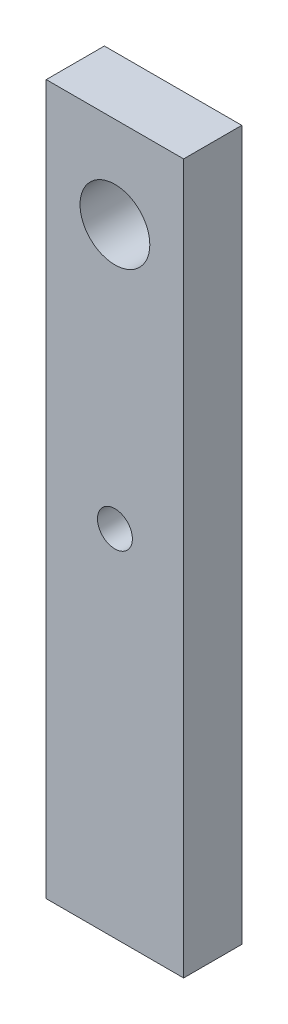
ISO-10303-21;
HEADER;
FILE_DESCRIPTION(('STEP AP214'),'2;1');
FILE_NAME('part.step','',(''),(''),'','','');
FILE_SCHEMA(('AUTOMOTIVE_DESIGN { 1 0 10303 214 1 1 1 1 }'));
ENDSEC;
DATA;
#1=APPLICATION_CONTEXT('core data for automotive mechanical design processes');
#2=APPLICATION_PROTOCOL_DEFINITION('international standard','automotive_design',2000,#1);
#3=PRODUCT_CONTEXT('',#1,'mechanical');
#4=PRODUCT('Part','Part','',(#3));
#5=PRODUCT_RELATED_PRODUCT_CATEGORY('part','',(#4));
#6=PRODUCT_DEFINITION_FORMATION('','',#4);
#7=PRODUCT_DEFINITION_CONTEXT('part definition',#1,'design');
#8=PRODUCT_DEFINITION('design','',#6,#7);
#9=PRODUCT_DEFINITION_SHAPE('','',#8);
#10=(LENGTH_UNIT() NAMED_UNIT(*) SI_UNIT(.MILLI.,.METRE.));
#11=(NAMED_UNIT(*) PLANE_ANGLE_UNIT() SI_UNIT($,.RADIAN.));
#12=(NAMED_UNIT(*) SI_UNIT($,.STERADIAN.) SOLID_ANGLE_UNIT());
#13=UNCERTAINTY_MEASURE_WITH_UNIT(LENGTH_MEASURE(1.E-05),#10,'distance_accuracy_value','');
#14=(GEOMETRIC_REPRESENTATION_CONTEXT(3) GLOBAL_UNCERTAINTY_ASSIGNED_CONTEXT((#13)) GLOBAL_UNIT_ASSIGNED_CONTEXT((#10,
#11,#12)) REPRESENTATION_CONTEXT('',''));
#15=CARTESIAN_POINT('',(0.,0.,0.));
#16=DIRECTION('',(0.,0.,1.));
#17=DIRECTION('',(1.,0.,0.));
#18=AXIS2_PLACEMENT_3D('',#15,#16,#17);
#19=CARTESIAN_POINT('',(0.,0.,10.));
#20=DIRECTION('',(0.,0.,-1.));
#21=DIRECTION('',(-1.,0.,0.));
#22=AXIS2_PLACEMENT_3D('',#19,#20,#21);
#23=PLANE('',#22);
#24=DIRECTION('',(0.,1.,0.));
#25=VECTOR('',#24,1.);
#26=CARTESIAN_POINT('',(11.8132314555088,-60.9892414679757,10.));
#27=LINE('',#26,#25);
#28=CARTESIAN_POINT('',(11.8132314555088,-60.9892414679757,10.));
#29=VERTEX_POINT('',#28);
#30=CARTESIAN_POINT('',(11.8132314555088,60.9892414679757,10.));
#31=VERTEX_POINT('',#30);
#32=EDGE_CURVE('E100',#29,#31,#27,.T.);
#33=ORIENTED_EDGE('',*,*,#32,.T.);
#34=DIRECTION('',(-1.,0.,0.));
#35=VECTOR('',#34,1.);
#36=CARTESIAN_POINT('',(-11.8132314555088,60.9892414679757,10.));
#37=LINE('',#36,#35);
#38=CARTESIAN_POINT('',(-11.8132314555088,60.9892414679757,10.));
#39=VERTEX_POINT('',#38);
#40=EDGE_CURVE('E95',#31,#39,#37,.T.);
#41=ORIENTED_EDGE('',*,*,#40,.T.);
#42=DIRECTION('',(0.,-1.,0.));
#43=VECTOR('',#42,1.);
#44=CARTESIAN_POINT('',(-11.8132314555088,-60.9892414679757,10.));
#45=LINE('',#44,#43);
#46=CARTESIAN_POINT('',(-11.8132314555088,-60.9892414679757,10.));
#47=VERTEX_POINT('',#46);
#48=EDGE_CURVE('E98',#39,#47,#45,.T.);
#49=ORIENTED_EDGE('',*,*,#48,.T.);
#50=DIRECTION('',(1.,0.,0.));
#51=VECTOR('',#50,1.);
#52=CARTESIAN_POINT('',(-11.8132314555088,-60.9892414679757,10.));
#53=LINE('',#52,#51);
#54=EDGE_CURVE('E65',#47,#29,#53,.T.);
#55=ORIENTED_EDGE('',*,*,#54,.T.);
#56=EDGE_LOOP('',(#33,#41,#49,#55));
#57=FACE_BOUND('',#56,.T.);
#58=CARTESIAN_POINT('',(0.,0.,10.));
#59=DIRECTION('',(0.,0.,1.));
#60=DIRECTION('',(1.,0.,0.));
#61=AXIS2_PLACEMENT_3D('',#58,#59,#60);
#62=CIRCLE('',#61,3.);
#63=CARTESIAN_POINT('',(3.,0.,10.));
#64=VERTEX_POINT('',#63);
#65=EDGE_CURVE('E120',#64,#64,#62,.T.);
#66=ORIENTED_EDGE('',*,*,#65,.F.);
#67=EDGE_LOOP('',(#66));
#68=FACE_BOUND('',#67,.T.);
#69=CARTESIAN_POINT('',(0.,45.2994882944264,10.));
#70=DIRECTION('',(0.,0.,1.));
#71=DIRECTION('',(1.,0.,0.));
#72=AXIS2_PLACEMENT_3D('',#69,#70,#71);
#73=CIRCLE('',#72,6.);
#74=CARTESIAN_POINT('',(6.,45.2994882944264,10.));
#75=VERTEX_POINT('',#74);
#76=EDGE_CURVE('E142',#75,#75,#73,.T.);
#77=ORIENTED_EDGE('',*,*,#76,.F.);
#78=EDGE_LOOP('',(#77));
#79=FACE_BOUND('',#78,.T.);
#80=ADVANCED_FACE('F47',(#57,#68,#79),#23,.F.);
#81=CARTESIAN_POINT('',(0.,0.,0.));
#82=DIRECTION('',(0.,0.,-1.));
#83=DIRECTION('',(-1.,0.,0.));
#84=AXIS2_PLACEMENT_3D('',#81,#82,#83);
#85=PLANE('',#84);
#86=CARTESIAN_POINT('',(0.,0.,0.));
#87=DIRECTION('',(0.,0.,1.));
#88=DIRECTION('',(1.,0.,0.));
#89=AXIS2_PLACEMENT_3D('',#86,#87,#88);
#90=CIRCLE('',#89,3.);
#91=CARTESIAN_POINT('',(3.,0.,0.));
#92=VERTEX_POINT('',#91);
#93=EDGE_CURVE('E138',#92,#92,#90,.T.);
#94=ORIENTED_EDGE('',*,*,#93,.T.);
#95=EDGE_LOOP('',(#94));
#96=FACE_BOUND('',#95,.T.);
#97=DIRECTION('',(0.,1.,0.));
#98=VECTOR('',#97,1.);
#99=CARTESIAN_POINT('',(11.8132314555088,-60.9892414679757,0.));
#100=LINE('',#99,#98);
#101=CARTESIAN_POINT('',(11.8132314555088,-60.9892414679757,0.));
#102=VERTEX_POINT('',#101);
#103=CARTESIAN_POINT('',(11.8132314555088,60.9892414679757,0.));
#104=VERTEX_POINT('',#103);
#105=EDGE_CURVE('E116',#102,#104,#100,.T.);
#106=ORIENTED_EDGE('',*,*,#105,.F.);
#107=DIRECTION('',(1.,0.,0.));
#108=VECTOR('',#107,1.);
#109=CARTESIAN_POINT('',(-11.8132314555088,-60.9892414679757,0.));
#110=LINE('',#109,#108);
#111=CARTESIAN_POINT('',(-11.8132314555088,-60.9892414679757,0.));
#112=VERTEX_POINT('',#111);
#113=EDGE_CURVE('E88',#112,#102,#110,.T.);
#114=ORIENTED_EDGE('',*,*,#113,.F.);
#115=DIRECTION('',(0.,-1.,0.));
#116=VECTOR('',#115,1.);
#117=CARTESIAN_POINT('',(-11.8132314555088,-60.9892414679757,0.));
#118=LINE('',#117,#116);
#119=CARTESIAN_POINT('',(-11.8132314555088,60.9892414679757,0.));
#120=VERTEX_POINT('',#119);
#121=EDGE_CURVE('E82',#120,#112,#118,.T.);
#122=ORIENTED_EDGE('',*,*,#121,.F.);
#123=DIRECTION('',(-1.,0.,0.));
#124=VECTOR('',#123,1.);
#125=CARTESIAN_POINT('',(-11.8132314555088,60.9892414679757,0.));
#126=LINE('',#125,#124);
#127=EDGE_CURVE('E105',#104,#120,#126,.T.);
#128=ORIENTED_EDGE('',*,*,#127,.F.);
#129=EDGE_LOOP('',(#106,#114,#122,#128));
#130=FACE_BOUND('',#129,.T.);
#131=CARTESIAN_POINT('',(0.,45.2994882944264,0.));
#132=DIRECTION('',(0.,0.,1.));
#133=DIRECTION('',(1.,0.,0.));
#134=AXIS2_PLACEMENT_3D('',#131,#132,#133);
#135=CIRCLE('',#134,6.);
#136=CARTESIAN_POINT('',(6.,45.2994882944264,0.));
#137=VERTEX_POINT('',#136);
#138=EDGE_CURVE('E146',#137,#137,#135,.T.);
#139=ORIENTED_EDGE('',*,*,#138,.T.);
#140=EDGE_LOOP('',(#139));
#141=FACE_BOUND('',#140,.T.);
#142=ADVANCED_FACE('F133',(#96,#130,#141),#85,.T.);
#143=CARTESIAN_POINT('',(11.8132314555088,-60.9892414679757,10.));
#144=DIRECTION('',(-1.,0.,0.));
#145=DIRECTION('',(0.,0.,1.));
#146=AXIS2_PLACEMENT_3D('',#143,#144,#145);
#147=PLANE('',#146);
#148=ORIENTED_EDGE('',*,*,#105,.T.);
#149=DIRECTION('',(0.,0.,-1.));
#150=VECTOR('',#149,1.);
#151=CARTESIAN_POINT('',(11.8132314555088,60.9892414679757,10.));
#152=LINE('',#151,#150);
#153=EDGE_CURVE('E11',#31,#104,#152,.T.);
#154=ORIENTED_EDGE('',*,*,#153,.F.);
#155=ORIENTED_EDGE('',*,*,#32,.F.);
#156=DIRECTION('',(0.,0.,-1.));
#157=VECTOR('',#156,1.);
#158=CARTESIAN_POINT('',(11.8132314555088,-60.9892414679757,10.));
#159=LINE('',#158,#157);
#160=EDGE_CURVE('E112',#29,#102,#159,.T.);
#161=ORIENTED_EDGE('',*,*,#160,.T.);
#162=EDGE_LOOP('',(#148,#154,#155,#161));
#163=FACE_BOUND('',#162,.T.);
#164=ADVANCED_FACE('F49',(#163),#147,.F.);
#165=CARTESIAN_POINT('',(-11.8132314555088,60.9892414679757,10.));
#166=DIRECTION('',(0.,-1.,0.));
#167=DIRECTION('',(0.,0.,-1.));
#168=AXIS2_PLACEMENT_3D('',#165,#166,#167);
#169=PLANE('',#168);
#170=ORIENTED_EDGE('',*,*,#127,.T.);
#171=DIRECTION('',(0.,0.,-1.));
#172=VECTOR('',#171,1.);
#173=CARTESIAN_POINT('',(-11.8132314555088,60.9892414679757,10.));
#174=LINE('',#173,#172);
#175=EDGE_CURVE('E57',#39,#120,#174,.T.);
#176=ORIENTED_EDGE('',*,*,#175,.F.);
#177=ORIENTED_EDGE('',*,*,#40,.F.);
#178=ORIENTED_EDGE('',*,*,#153,.T.);
#179=EDGE_LOOP('',(#170,#176,#177,#178));
#180=FACE_BOUND('',#179,.T.);
#181=ADVANCED_FACE('F104',(#180),#169,.F.);
#182=CARTESIAN_POINT('',(-11.8132314555088,-60.9892414679757,10.));
#183=DIRECTION('',(1.,0.,0.));
#184=DIRECTION('',(0.,0.,-1.));
#185=AXIS2_PLACEMENT_3D('',#182,#183,#184);
#186=PLANE('',#185);
#187=ORIENTED_EDGE('',*,*,#121,.T.);
#188=DIRECTION('',(0.,0.,-1.));
#189=VECTOR('',#188,1.);
#190=CARTESIAN_POINT('',(-11.8132314555088,-60.9892414679757,10.));
#191=LINE('',#190,#189);
#192=EDGE_CURVE('E107',#47,#112,#191,.T.);
#193=ORIENTED_EDGE('',*,*,#192,.F.);
#194=ORIENTED_EDGE('',*,*,#48,.F.);
#195=ORIENTED_EDGE('',*,*,#175,.T.);
#196=EDGE_LOOP('',(#187,#193,#194,#195));
#197=FACE_BOUND('',#196,.T.);
#198=ADVANCED_FACE('F108',(#197),#186,.F.);
#199=CARTESIAN_POINT('',(-11.8132314555088,-60.9892414679757,10.));
#200=DIRECTION('',(0.,1.,0.));
#201=DIRECTION('',(0.,0.,1.));
#202=AXIS2_PLACEMENT_3D('',#199,#200,#201);
#203=PLANE('',#202);
#204=ORIENTED_EDGE('',*,*,#113,.T.);
#205=ORIENTED_EDGE('',*,*,#160,.F.);
#206=ORIENTED_EDGE('',*,*,#54,.F.);
#207=ORIENTED_EDGE('',*,*,#192,.T.);
#208=EDGE_LOOP('',(#204,#205,#206,#207));
#209=FACE_BOUND('',#208,.T.);
#210=ADVANCED_FACE('F130',(#209),#203,.F.);
#211=CARTESIAN_POINT('',(0.,0.,10.));
#212=DIRECTION('',(0.,0.,-1.));
#213=DIRECTION('',(-1.,0.,0.));
#214=AXIS2_PLACEMENT_3D('',#211,#212,#213);
#215=CYLINDRICAL_SURFACE('',#214,3.);
#216=ORIENTED_EDGE('',*,*,#65,.T.);
#217=EDGE_LOOP('',(#216));
#218=FACE_BOUND('',#217,.T.);
#219=ORIENTED_EDGE('',*,*,#93,.F.);
#220=EDGE_LOOP('',(#219));
#221=FACE_BOUND('',#220,.T.);
#222=ADVANCED_FACE('F164',(#218,#221),#215,.F.);
#223=CARTESIAN_POINT('',(0.,45.2994882944264,10.));
#224=DIRECTION('',(0.,0.,-1.));
#225=DIRECTION('',(-1.,0.,0.));
#226=AXIS2_PLACEMENT_3D('',#223,#224,#225);
#227=CYLINDRICAL_SURFACE('',#226,6.);
#228=ORIENTED_EDGE('',*,*,#76,.T.);
#229=EDGE_LOOP('',(#228));
#230=FACE_BOUND('',#229,.T.);
#231=ORIENTED_EDGE('',*,*,#138,.F.);
#232=EDGE_LOOP('',(#231));
#233=FACE_BOUND('',#232,.T.);
#234=ADVANCED_FACE('F154',(#230,#233),#227,.F.);
#235=CLOSED_SHELL('',(#80,#142,#164,#181,#198,#210,#222,#234));
#236=MANIFOLD_SOLID_BREP('B2',#235);
#237=ADVANCED_BREP_SHAPE_REPRESENTATION('',(#18,#236),#14);
#238=SHAPE_DEFINITION_REPRESENTATION(#9,#237);
ENDSEC;
END-ISO-10303-21;
